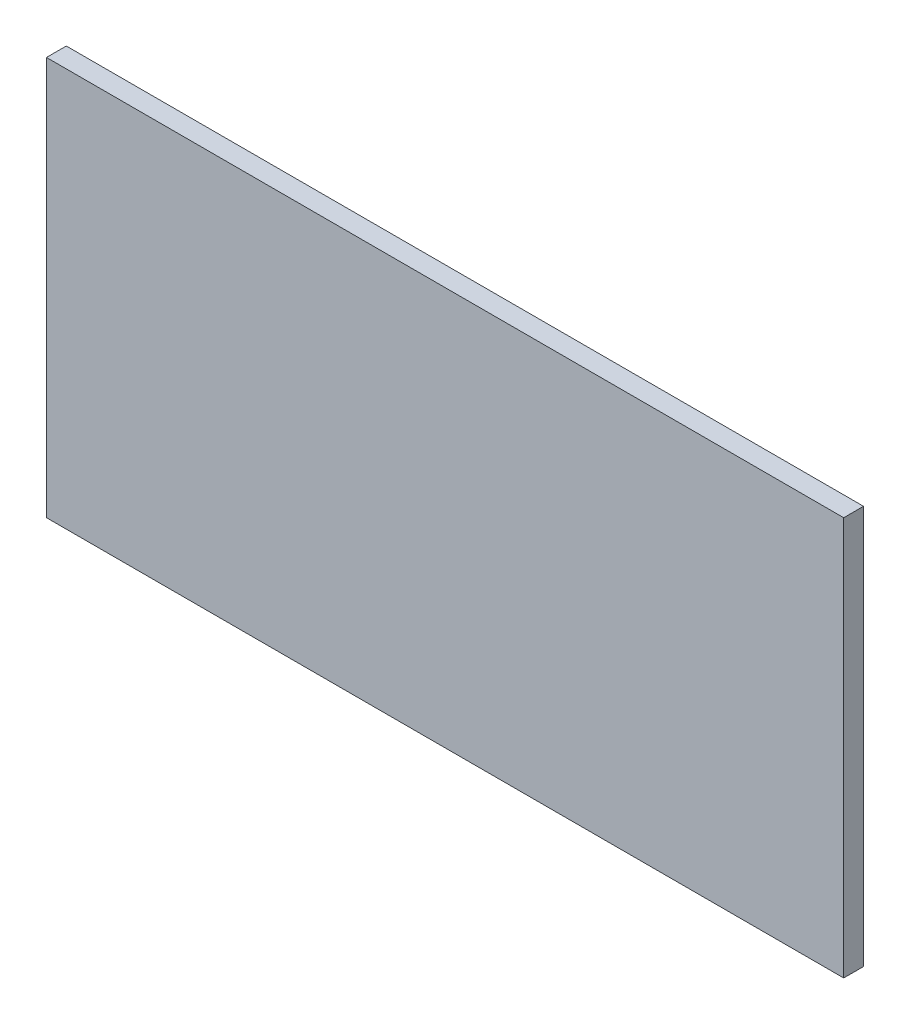
ISO-10303-21;
HEADER;
FILE_DESCRIPTION(('STEP AP214'),'2;1');
FILE_NAME('part.step','',(''),(''),'','','');
FILE_SCHEMA(('AUTOMOTIVE_DESIGN { 1 0 10303 214 1 1 1 1 }'));
ENDSEC;
DATA;
#1=APPLICATION_CONTEXT('core data for automotive mechanical design processes');
#2=APPLICATION_PROTOCOL_DEFINITION('international standard','automotive_design',2000,#1);
#3=PRODUCT_CONTEXT('',#1,'mechanical');
#4=PRODUCT('Part','Part','',(#3));
#5=PRODUCT_RELATED_PRODUCT_CATEGORY('part','',(#4));
#6=PRODUCT_DEFINITION_FORMATION('','',#4);
#7=PRODUCT_DEFINITION_CONTEXT('part definition',#1,'design');
#8=PRODUCT_DEFINITION('design','',#6,#7);
#9=PRODUCT_DEFINITION_SHAPE('','',#8);
#10=(LENGTH_UNIT() NAMED_UNIT(*) SI_UNIT(.MILLI.,.METRE.));
#11=(NAMED_UNIT(*) PLANE_ANGLE_UNIT() SI_UNIT($,.RADIAN.));
#12=(NAMED_UNIT(*) SI_UNIT($,.STERADIAN.) SOLID_ANGLE_UNIT());
#13=UNCERTAINTY_MEASURE_WITH_UNIT(LENGTH_MEASURE(1.E-05),#10,'distance_accuracy_value','');
#14=(GEOMETRIC_REPRESENTATION_CONTEXT(3) GLOBAL_UNCERTAINTY_ASSIGNED_CONTEXT((#13)) GLOBAL_UNIT_ASSIGNED_CONTEXT((#10,
#11,#12)) REPRESENTATION_CONTEXT('',''));
#15=CARTESIAN_POINT('',(0.,0.,0.));
#16=DIRECTION('',(0.,0.,1.));
#17=DIRECTION('',(1.,0.,0.));
#18=AXIS2_PLACEMENT_3D('',#15,#16,#17);
#19=CARTESIAN_POINT('',(90.5,90.5,2.25));
#20=DIRECTION('',(-1.,0.,0.));
#21=DIRECTION('',(0.,0.,1.));
#22=AXIS2_PLACEMENT_3D('',#19,#20,#21);
#23=PLANE('',#22);
#24=DIRECTION('',(0.,1.,0.));
#25=VECTOR('',#24,1.);
#26=CARTESIAN_POINT('',(90.5,90.5,-2.25));
#27=LINE('',#26,#25);
#28=CARTESIAN_POINT('',(90.5,0.,-2.25));
#29=VERTEX_POINT('',#28);
#30=CARTESIAN_POINT('',(90.5,90.5,-2.25));
#31=VERTEX_POINT('',#30);
#32=EDGE_CURVE('E96',#29,#31,#27,.T.);
#33=ORIENTED_EDGE('',*,*,#32,.T.);
#34=DIRECTION('',(0.,0.,-1.));
#35=VECTOR('',#34,1.);
#36=CARTESIAN_POINT('',(90.5,90.5,2.25));
#37=LINE('',#36,#35);
#38=CARTESIAN_POINT('',(90.5,90.5,2.25));
#39=VERTEX_POINT('',#38);
#40=EDGE_CURVE('E11',#39,#31,#37,.T.);
#41=ORIENTED_EDGE('',*,*,#40,.F.);
#42=DIRECTION('',(0.,1.,0.));
#43=VECTOR('',#42,1.);
#44=CARTESIAN_POINT('',(90.5,90.5,2.25));
#45=LINE('',#44,#43);
#46=CARTESIAN_POINT('',(90.5,0.,2.25));
#47=VERTEX_POINT('',#46);
#48=EDGE_CURVE('E84',#47,#39,#45,.T.);
#49=ORIENTED_EDGE('',*,*,#48,.F.);
#50=DIRECTION('',(0.,0.,-1.));
#51=VECTOR('',#50,1.);
#52=CARTESIAN_POINT('',(90.5,0.,2.25));
#53=LINE('',#52,#51);
#54=EDGE_CURVE('E92',#47,#29,#53,.T.);
#55=ORIENTED_EDGE('',*,*,#54,.T.);
#56=EDGE_LOOP('',(#33,#41,#49,#55));
#57=FACE_BOUND('',#56,.T.);
#58=ADVANCED_FACE('F33',(#57),#23,.F.);
#59=CARTESIAN_POINT('',(-90.5,90.5,2.25));
#60=DIRECTION('',(0.,-1.,0.));
#61=DIRECTION('',(0.,0.,-1.));
#62=AXIS2_PLACEMENT_3D('',#59,#60,#61);
#63=PLANE('',#62);
#64=DIRECTION('',(-1.,0.,0.));
#65=VECTOR('',#64,1.);
#66=CARTESIAN_POINT('',(-90.5,90.5,-2.25));
#67=LINE('',#66,#65);
#68=CARTESIAN_POINT('',(-90.5,90.5,-2.25));
#69=VERTEX_POINT('',#68);
#70=EDGE_CURVE('E88',#31,#69,#67,.T.);
#71=ORIENTED_EDGE('',*,*,#70,.T.);
#72=DIRECTION('',(0.,0.,-1.));
#73=VECTOR('',#72,1.);
#74=CARTESIAN_POINT('',(-90.5,90.5,2.25));
#75=LINE('',#74,#73);
#76=CARTESIAN_POINT('',(-90.5,90.5,2.25));
#77=VERTEX_POINT('',#76);
#78=EDGE_CURVE('E41',#77,#69,#75,.T.);
#79=ORIENTED_EDGE('',*,*,#78,.F.);
#80=DIRECTION('',(-1.,0.,0.));
#81=VECTOR('',#80,1.);
#82=CARTESIAN_POINT('',(-90.5,90.5,2.25));
#83=LINE('',#82,#81);
#84=EDGE_CURVE('E79',#39,#77,#83,.T.);
#85=ORIENTED_EDGE('',*,*,#84,.F.);
#86=ORIENTED_EDGE('',*,*,#40,.T.);
#87=EDGE_LOOP('',(#71,#79,#85,#86));
#88=FACE_BOUND('',#87,.T.);
#89=ADVANCED_FACE('F87',(#88),#63,.F.);
#90=CARTESIAN_POINT('',(-90.5,90.5,2.25));
#91=DIRECTION('',(1.,0.,0.));
#92=DIRECTION('',(0.,0.,-1.));
#93=AXIS2_PLACEMENT_3D('',#90,#91,#92);
#94=PLANE('',#93);
#95=DIRECTION('',(0.,-1.,0.));
#96=VECTOR('',#95,1.);
#97=CARTESIAN_POINT('',(-90.5,90.5,-2.25));
#98=LINE('',#97,#96);
#99=CARTESIAN_POINT('',(-90.5,0.,-2.25));
#100=VERTEX_POINT('',#99);
#101=EDGE_CURVE('E66',#69,#100,#98,.T.);
#102=ORIENTED_EDGE('',*,*,#101,.T.);
#103=DIRECTION('',(0.,0.,-1.));
#104=VECTOR('',#103,1.);
#105=CARTESIAN_POINT('',(-90.5,0.,2.25));
#106=LINE('',#105,#104);
#107=CARTESIAN_POINT('',(-90.5,0.,2.25));
#108=VERTEX_POINT('',#107);
#109=EDGE_CURVE('E89',#108,#100,#106,.T.);
#110=ORIENTED_EDGE('',*,*,#109,.F.);
#111=DIRECTION('',(0.,-1.,0.));
#112=VECTOR('',#111,1.);
#113=CARTESIAN_POINT('',(-90.5,90.5,2.25));
#114=LINE('',#113,#112);
#115=EDGE_CURVE('E82',#77,#108,#114,.T.);
#116=ORIENTED_EDGE('',*,*,#115,.F.);
#117=ORIENTED_EDGE('',*,*,#78,.T.);
#118=EDGE_LOOP('',(#102,#110,#116,#117));
#119=FACE_BOUND('',#118,.T.);
#120=ADVANCED_FACE('F90',(#119),#94,.F.);
#121=CARTESIAN_POINT('',(-90.5,0.,2.25));
#122=DIRECTION('',(0.,1.,0.));
#123=DIRECTION('',(0.,0.,1.));
#124=AXIS2_PLACEMENT_3D('',#121,#122,#123);
#125=PLANE('',#124);
#126=DIRECTION('',(1.,0.,0.));
#127=VECTOR('',#126,1.);
#128=CARTESIAN_POINT('',(-90.5,0.,-2.25));
#129=LINE('',#128,#127);
#130=EDGE_CURVE('E72',#100,#29,#129,.T.);
#131=ORIENTED_EDGE('',*,*,#130,.T.);
#132=ORIENTED_EDGE('',*,*,#54,.F.);
#133=DIRECTION('',(1.,0.,0.));
#134=VECTOR('',#133,1.);
#135=CARTESIAN_POINT('',(-90.5,0.,2.25));
#136=LINE('',#135,#134);
#137=EDGE_CURVE('E49',#108,#47,#136,.T.);
#138=ORIENTED_EDGE('',*,*,#137,.F.);
#139=ORIENTED_EDGE('',*,*,#109,.T.);
#140=EDGE_LOOP('',(#131,#132,#138,#139));
#141=FACE_BOUND('',#140,.T.);
#142=ADVANCED_FACE('F103',(#141),#125,.F.);
#143=CARTESIAN_POINT('',(0.,0.,2.25));
#144=DIRECTION('',(0.,0.,1.));
#145=DIRECTION('',(1.,0.,0.));
#146=AXIS2_PLACEMENT_3D('',#143,#144,#145);
#147=PLANE('',#146);
#148=ORIENTED_EDGE('',*,*,#48,.T.);
#149=ORIENTED_EDGE('',*,*,#84,.T.);
#150=ORIENTED_EDGE('',*,*,#115,.T.);
#151=ORIENTED_EDGE('',*,*,#137,.T.);
#152=EDGE_LOOP('',(#148,#149,#150,#151));
#153=FACE_BOUND('',#152,.T.);
#154=ADVANCED_FACE('F80',(#153),#147,.T.);
#155=CARTESIAN_POINT('',(0.,0.,-2.25));
#156=DIRECTION('',(0.,0.,1.));
#157=DIRECTION('',(1.,0.,0.));
#158=AXIS2_PLACEMENT_3D('',#155,#156,#157);
#159=PLANE('',#158);
#160=ORIENTED_EDGE('',*,*,#32,.F.);
#161=ORIENTED_EDGE('',*,*,#130,.F.);
#162=ORIENTED_EDGE('',*,*,#101,.F.);
#163=ORIENTED_EDGE('',*,*,#70,.F.);
#164=EDGE_LOOP('',(#160,#161,#162,#163));
#165=FACE_BOUND('',#164,.T.);
#166=ADVANCED_FACE('F106',(#165),#159,.F.);
#167=CLOSED_SHELL('',(#58,#89,#120,#142,#154,#166));
#168=MANIFOLD_SOLID_BREP('B2',#167);
#169=ADVANCED_BREP_SHAPE_REPRESENTATION('',(#18,#168),#14);
#170=SHAPE_DEFINITION_REPRESENTATION(#9,#169);
ENDSEC;
END-ISO-10303-21;
